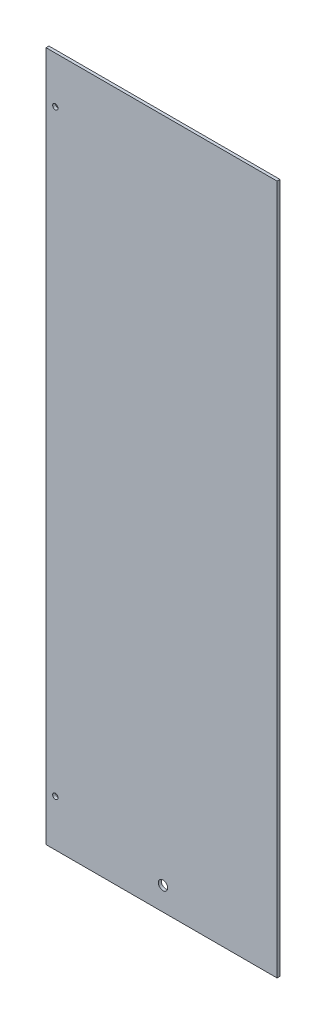
ISO-10303-21;
HEADER;
FILE_DESCRIPTION(('STEP AP214'),'2;1');
FILE_NAME('part.step','',(''),(''),'','','');
FILE_SCHEMA(('AUTOMOTIVE_DESIGN { 1 0 10303 214 1 1 1 1 }'));
ENDSEC;
DATA;
#1=APPLICATION_CONTEXT('core data for automotive mechanical design processes');
#2=APPLICATION_PROTOCOL_DEFINITION('international standard','automotive_design',2000,#1);
#3=PRODUCT_CONTEXT('',#1,'mechanical');
#4=PRODUCT('Part','Part','',(#3));
#5=PRODUCT_RELATED_PRODUCT_CATEGORY('part','',(#4));
#6=PRODUCT_DEFINITION_FORMATION('','',#4);
#7=PRODUCT_DEFINITION_CONTEXT('part definition',#1,'design');
#8=PRODUCT_DEFINITION('design','',#6,#7);
#9=PRODUCT_DEFINITION_SHAPE('','',#8);
#10=(LENGTH_UNIT() NAMED_UNIT(*) SI_UNIT(.MILLI.,.METRE.));
#11=(NAMED_UNIT(*) PLANE_ANGLE_UNIT() SI_UNIT($,.RADIAN.));
#12=(NAMED_UNIT(*) SI_UNIT($,.STERADIAN.) SOLID_ANGLE_UNIT());
#13=UNCERTAINTY_MEASURE_WITH_UNIT(LENGTH_MEASURE(1.E-05),#10,'distance_accuracy_value','');
#14=(GEOMETRIC_REPRESENTATION_CONTEXT(3) GLOBAL_UNCERTAINTY_ASSIGNED_CONTEXT((#13)) GLOBAL_UNIT_ASSIGNED_CONTEXT((#10,
#11,#12)) REPRESENTATION_CONTEXT('',''));
#15=CARTESIAN_POINT('',(0.,0.,0.));
#16=DIRECTION('',(0.,0.,1.));
#17=DIRECTION('',(1.,0.,0.));
#18=AXIS2_PLACEMENT_3D('',#15,#16,#17);
#19=CARTESIAN_POINT('',(0.,0.,1.5875));
#20=DIRECTION('',(1.,0.,0.));
#21=DIRECTION('',(0.,0.,-1.));
#22=AXIS2_PLACEMENT_3D('',#19,#20,#21);
#23=PLANE('',#22);
#24=DIRECTION('',(0.,-1.,0.));
#25=VECTOR('',#24,1.);
#26=CARTESIAN_POINT('',(0.,0.,0.));
#27=LINE('',#26,#25);
#28=CARTESIAN_POINT('',(0.,376.555,0.));
#29=VERTEX_POINT('',#28);
#30=CARTESIAN_POINT('',(0.,0.,0.));
#31=VERTEX_POINT('',#30);
#32=EDGE_CURVE('E99',#29,#31,#27,.T.);
#33=ORIENTED_EDGE('',*,*,#32,.T.);
#34=DIRECTION('',(0.,0.,-1.));
#35=VECTOR('',#34,1.);
#36=CARTESIAN_POINT('',(0.,0.,1.5875));
#37=LINE('',#36,#35);
#38=CARTESIAN_POINT('',(0.,0.,1.5875));
#39=VERTEX_POINT('',#38);
#40=EDGE_CURVE('E11',#39,#31,#37,.T.);
#41=ORIENTED_EDGE('',*,*,#40,.F.);
#42=DIRECTION('',(0.,-1.,0.));
#43=VECTOR('',#42,1.);
#44=CARTESIAN_POINT('',(0.,0.,1.5875));
#45=LINE('',#44,#43);
#46=CARTESIAN_POINT('',(0.,376.555,1.5875));
#47=VERTEX_POINT('',#46);
#48=EDGE_CURVE('E86',#47,#39,#45,.T.);
#49=ORIENTED_EDGE('',*,*,#48,.F.);
#50=DIRECTION('',(0.,0.,-1.));
#51=VECTOR('',#50,1.);
#52=CARTESIAN_POINT('',(0.,376.555,1.5875));
#53=LINE('',#52,#51);
#54=EDGE_CURVE('E95',#47,#29,#53,.T.);
#55=ORIENTED_EDGE('',*,*,#54,.T.);
#56=EDGE_LOOP('',(#33,#41,#49,#55));
#57=FACE_BOUND('',#56,.T.);
#58=ADVANCED_FACE('F33',(#57),#23,.F.);
#59=CARTESIAN_POINT('',(0.,0.,1.5875));
#60=DIRECTION('',(0.,1.,0.));
#61=DIRECTION('',(0.,0.,1.));
#62=AXIS2_PLACEMENT_3D('',#59,#60,#61);
#63=PLANE('',#62);
#64=DIRECTION('',(1.,0.,0.));
#65=VECTOR('',#64,1.);
#66=CARTESIAN_POINT('',(0.,0.,0.));
#67=LINE('',#66,#65);
#68=CARTESIAN_POINT('',(126.0475,0.,0.));
#69=VERTEX_POINT('',#68);
#70=EDGE_CURVE('E90',#31,#69,#67,.T.);
#71=ORIENTED_EDGE('',*,*,#70,.T.);
#72=DIRECTION('',(0.,0.,-1.));
#73=VECTOR('',#72,1.);
#74=CARTESIAN_POINT('',(126.0475,0.,1.5875));
#75=LINE('',#74,#73);
#76=CARTESIAN_POINT('',(126.0475,0.,1.5875));
#77=VERTEX_POINT('',#76);
#78=EDGE_CURVE('E42',#77,#69,#75,.T.);
#79=ORIENTED_EDGE('',*,*,#78,.F.);
#80=DIRECTION('',(1.,0.,0.));
#81=VECTOR('',#80,1.);
#82=CARTESIAN_POINT('',(0.,0.,1.5875));
#83=LINE('',#82,#81);
#84=EDGE_CURVE('E81',#39,#77,#83,.T.);
#85=ORIENTED_EDGE('',*,*,#84,.F.);
#86=ORIENTED_EDGE('',*,*,#40,.T.);
#87=EDGE_LOOP('',(#71,#79,#85,#86));
#88=FACE_BOUND('',#87,.T.);
#89=ADVANCED_FACE('F89',(#88),#63,.F.);
#90=CARTESIAN_POINT('',(126.0475,0.,1.5875));
#91=DIRECTION('',(-1.,0.,0.));
#92=DIRECTION('',(0.,0.,1.));
#93=AXIS2_PLACEMENT_3D('',#90,#91,#92);
#94=PLANE('',#93);
#95=DIRECTION('',(0.,1.,0.));
#96=VECTOR('',#95,1.);
#97=CARTESIAN_POINT('',(126.0475,0.,0.));
#98=LINE('',#97,#96);
#99=CARTESIAN_POINT('',(126.0475,376.555,0.));
#100=VERTEX_POINT('',#99);
#101=EDGE_CURVE('E68',#69,#100,#98,.T.);
#102=ORIENTED_EDGE('',*,*,#101,.T.);
#103=DIRECTION('',(0.,0.,-1.));
#104=VECTOR('',#103,1.);
#105=CARTESIAN_POINT('',(126.0475,376.555,1.5875));
#106=LINE('',#105,#104);
#107=CARTESIAN_POINT('',(126.0475,376.555,1.5875));
#108=VERTEX_POINT('',#107);
#109=EDGE_CURVE('E91',#108,#100,#106,.T.);
#110=ORIENTED_EDGE('',*,*,#109,.F.);
#111=DIRECTION('',(0.,1.,0.));
#112=VECTOR('',#111,1.);
#113=CARTESIAN_POINT('',(126.0475,0.,1.5875));
#114=LINE('',#113,#112);
#115=EDGE_CURVE('E84',#77,#108,#114,.T.);
#116=ORIENTED_EDGE('',*,*,#115,.F.);
#117=ORIENTED_EDGE('',*,*,#78,.T.);
#118=EDGE_LOOP('',(#102,#110,#116,#117));
#119=FACE_BOUND('',#118,.T.);
#120=ADVANCED_FACE('F93',(#119),#94,.F.);
#121=CARTESIAN_POINT('',(0.,376.555,1.5875));
#122=DIRECTION('',(0.,-1.,0.));
#123=DIRECTION('',(0.,0.,-1.));
#124=AXIS2_PLACEMENT_3D('',#121,#122,#123);
#125=PLANE('',#124);
#126=DIRECTION('',(-1.,0.,0.));
#127=VECTOR('',#126,1.);
#128=CARTESIAN_POINT('',(0.,376.555,0.));
#129=LINE('',#128,#127);
#130=EDGE_CURVE('E74',#100,#29,#129,.T.);
#131=ORIENTED_EDGE('',*,*,#130,.T.);
#132=ORIENTED_EDGE('',*,*,#54,.F.);
#133=DIRECTION('',(-1.,0.,0.));
#134=VECTOR('',#133,1.);
#135=CARTESIAN_POINT('',(0.,376.555,1.5875));
#136=LINE('',#135,#134);
#137=EDGE_CURVE('E51',#108,#47,#136,.T.);
#138=ORIENTED_EDGE('',*,*,#137,.F.);
#139=ORIENTED_EDGE('',*,*,#109,.T.);
#140=EDGE_LOOP('',(#131,#132,#138,#139));
#141=FACE_BOUND('',#140,.T.);
#142=ADVANCED_FACE('F132',(#141),#125,.F.);
#143=CARTESIAN_POINT('',(0.,0.,1.5875));
#144=DIRECTION('',(0.,0.,-1.));
#145=DIRECTION('',(-1.,0.,0.));
#146=AXIS2_PLACEMENT_3D('',#143,#144,#145);
#147=PLANE('',#146);
#148=CARTESIAN_POINT('',(63.8175,12.7,1.5875));
#149=DIRECTION('',(0.,0.,1.));
#150=DIRECTION('',(1.,0.,0.));
#151=AXIS2_PLACEMENT_3D('',#148,#149,#150);
#152=CIRCLE('',#151,2.54);
#153=CARTESIAN_POINT('',(66.3575,12.7,1.5875));
#154=VERTEX_POINT('',#153);
#155=EDGE_CURVE('E122',#154,#154,#152,.T.);
#156=ORIENTED_EDGE('',*,*,#155,.F.);
#157=EDGE_LOOP('',(#156));
#158=FACE_BOUND('',#157,.T.);
#159=CARTESIAN_POINT('',(5.08,25.4,1.5875));
#160=DIRECTION('',(0.,0.,1.));
#161=DIRECTION('',(1.,0.,0.));
#162=AXIS2_PLACEMENT_3D('',#159,#160,#161);
#163=CIRCLE('',#162,1.4605);
#164=CARTESIAN_POINT('',(6.5405,25.4,1.5875));
#165=VERTEX_POINT('',#164);
#166=EDGE_CURVE('E112',#165,#165,#163,.T.);
#167=ORIENTED_EDGE('',*,*,#166,.F.);
#168=EDGE_LOOP('',(#167));
#169=FACE_BOUND('',#168,.T.);
#170=CARTESIAN_POINT('',(5.08,351.155,1.5875));
#171=DIRECTION('',(0.,0.,1.));
#172=DIRECTION('',(1.,0.,0.));
#173=AXIS2_PLACEMENT_3D('',#170,#171,#172);
#174=CIRCLE('',#173,1.4605);
#175=CARTESIAN_POINT('',(6.5405,351.155,1.5875));
#176=VERTEX_POINT('',#175);
#177=EDGE_CURVE('E109',#176,#176,#174,.T.);
#178=ORIENTED_EDGE('',*,*,#177,.F.);
#179=EDGE_LOOP('',(#178));
#180=FACE_BOUND('',#179,.T.);
#181=ORIENTED_EDGE('',*,*,#48,.T.);
#182=ORIENTED_EDGE('',*,*,#84,.T.);
#183=ORIENTED_EDGE('',*,*,#115,.T.);
#184=ORIENTED_EDGE('',*,*,#137,.T.);
#185=EDGE_LOOP('',(#181,#182,#183,#184));
#186=FACE_BOUND('',#185,.T.);
#187=ADVANCED_FACE('F82',(#158,#169,#180,#186),#147,.F.);
#188=CARTESIAN_POINT('',(0.,0.,0.));
#189=DIRECTION('',(0.,0.,-1.));
#190=DIRECTION('',(-1.,0.,0.));
#191=AXIS2_PLACEMENT_3D('',#188,#189,#190);
#192=PLANE('',#191);
#193=CARTESIAN_POINT('',(63.8175,12.7,0.));
#194=DIRECTION('',(0.,0.,-1.));
#195=DIRECTION('',(-1.,0.,0.));
#196=AXIS2_PLACEMENT_3D('',#193,#194,#195);
#197=CIRCLE('',#196,2.54);
#198=CARTESIAN_POINT('',(61.2775,12.7,0.));
#199=VERTEX_POINT('',#198);
#200=EDGE_CURVE('E36',#199,#199,#197,.T.);
#201=ORIENTED_EDGE('',*,*,#200,.F.);
#202=EDGE_LOOP('',(#201));
#203=FACE_BOUND('',#202,.T.);
#204=CARTESIAN_POINT('',(5.08,25.4,0.));
#205=DIRECTION('',(0.,0.,-1.));
#206=DIRECTION('',(-1.,0.,0.));
#207=AXIS2_PLACEMENT_3D('',#204,#205,#206);
#208=CIRCLE('',#207,1.4605);
#209=CARTESIAN_POINT('',(3.6195,25.4,0.));
#210=VERTEX_POINT('',#209);
#211=EDGE_CURVE('E110',#210,#210,#208,.T.);
#212=ORIENTED_EDGE('',*,*,#211,.F.);
#213=EDGE_LOOP('',(#212));
#214=FACE_BOUND('',#213,.T.);
#215=CARTESIAN_POINT('',(5.08,351.155,0.));
#216=DIRECTION('',(0.,0.,-1.));
#217=DIRECTION('',(-1.,0.,0.));
#218=AXIS2_PLACEMENT_3D('',#215,#216,#217);
#219=CIRCLE('',#218,1.4605);
#220=CARTESIAN_POINT('',(3.6195,351.155,0.));
#221=VERTEX_POINT('',#220);
#222=EDGE_CURVE('E102',#221,#221,#219,.T.);
#223=ORIENTED_EDGE('',*,*,#222,.F.);
#224=EDGE_LOOP('',(#223));
#225=FACE_BOUND('',#224,.T.);
#226=ORIENTED_EDGE('',*,*,#32,.F.);
#227=ORIENTED_EDGE('',*,*,#130,.F.);
#228=ORIENTED_EDGE('',*,*,#101,.F.);
#229=ORIENTED_EDGE('',*,*,#70,.F.);
#230=EDGE_LOOP('',(#226,#227,#228,#229));
#231=FACE_BOUND('',#230,.T.);
#232=ADVANCED_FACE('F131',(#203,#214,#225,#231),#192,.T.);
#233=CARTESIAN_POINT('',(5.08,351.155,-4.7625));
#234=DIRECTION('',(0.,0.,1.));
#235=DIRECTION('',(1.,0.,0.));
#236=AXIS2_PLACEMENT_3D('',#233,#234,#235);
#237=CYLINDRICAL_SURFACE('',#236,1.4605);
#238=ORIENTED_EDGE('',*,*,#222,.T.);
#239=EDGE_LOOP('',(#238));
#240=FACE_BOUND('',#239,.T.);
#241=ORIENTED_EDGE('',*,*,#177,.T.);
#242=EDGE_LOOP('',(#241));
#243=FACE_BOUND('',#242,.T.);
#244=ADVANCED_FACE('F137',(#240,#243),#237,.F.);
#245=CARTESIAN_POINT('',(5.08,25.4,-4.7625));
#246=DIRECTION('',(0.,0.,1.));
#247=DIRECTION('',(1.,0.,0.));
#248=AXIS2_PLACEMENT_3D('',#245,#246,#247);
#249=CYLINDRICAL_SURFACE('',#248,1.4605);
#250=ORIENTED_EDGE('',*,*,#211,.T.);
#251=EDGE_LOOP('',(#250));
#252=FACE_BOUND('',#251,.T.);
#253=ORIENTED_EDGE('',*,*,#166,.T.);
#254=EDGE_LOOP('',(#253));
#255=FACE_BOUND('',#254,.T.);
#256=ADVANCED_FACE('F139',(#252,#255),#249,.F.);
#257=CARTESIAN_POINT('',(63.8175,12.7,-4.7625));
#258=DIRECTION('',(0.,0.,1.));
#259=DIRECTION('',(1.,0.,0.));
#260=AXIS2_PLACEMENT_3D('',#257,#258,#259);
#261=CYLINDRICAL_SURFACE('',#260,2.54);
#262=ORIENTED_EDGE('',*,*,#200,.T.);
#263=EDGE_LOOP('',(#262));
#264=FACE_BOUND('',#263,.T.);
#265=ORIENTED_EDGE('',*,*,#155,.T.);
#266=EDGE_LOOP('',(#265));
#267=FACE_BOUND('',#266,.T.);
#268=ADVANCED_FACE('F127',(#264,#267),#261,.F.);
#269=CLOSED_SHELL('',(#58,#89,#120,#142,#187,#232,#244,#256,#268));
#270=MANIFOLD_SOLID_BREP('B2',#269);
#271=ADVANCED_BREP_SHAPE_REPRESENTATION('',(#18,#270),#14);
#272=SHAPE_DEFINITION_REPRESENTATION(#9,#271);
ENDSEC;
END-ISO-10303-21;
